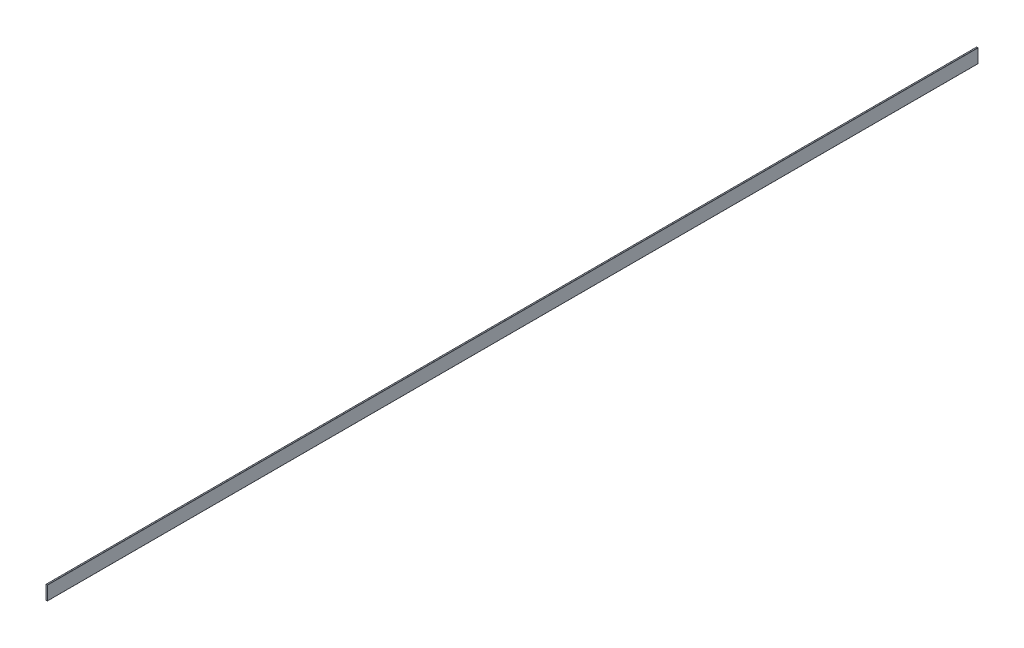
ISO-10303-21;
HEADER;
FILE_DESCRIPTION(('STEP AP214'),'2;1');
FILE_NAME('part.step','',(''),(''),'','','');
FILE_SCHEMA(('AUTOMOTIVE_DESIGN { 1 0 10303 214 1 1 1 1 }'));
ENDSEC;
DATA;
#1=APPLICATION_CONTEXT('core data for automotive mechanical design processes');
#2=APPLICATION_PROTOCOL_DEFINITION('international standard','automotive_design',2000,#1);
#3=PRODUCT_CONTEXT('',#1,'mechanical');
#4=PRODUCT('Part','Part','',(#3));
#5=PRODUCT_RELATED_PRODUCT_CATEGORY('part','',(#4));
#6=PRODUCT_DEFINITION_FORMATION('','',#4);
#7=PRODUCT_DEFINITION_CONTEXT('part definition',#1,'design');
#8=PRODUCT_DEFINITION('design','',#6,#7);
#9=PRODUCT_DEFINITION_SHAPE('','',#8);
#10=(LENGTH_UNIT() NAMED_UNIT(*) SI_UNIT(.MILLI.,.METRE.));
#11=(NAMED_UNIT(*) PLANE_ANGLE_UNIT() SI_UNIT($,.RADIAN.));
#12=(NAMED_UNIT(*) SI_UNIT($,.STERADIAN.) SOLID_ANGLE_UNIT());
#13=UNCERTAINTY_MEASURE_WITH_UNIT(LENGTH_MEASURE(1.E-05),#10,'distance_accuracy_value','');
#14=(GEOMETRIC_REPRESENTATION_CONTEXT(3) GLOBAL_UNCERTAINTY_ASSIGNED_CONTEXT((#13)) GLOBAL_UNIT_ASSIGNED_CONTEXT((#10,
#11,#12)) REPRESENTATION_CONTEXT('',''));
#15=CARTESIAN_POINT('',(0.,0.,0.));
#16=DIRECTION('',(0.,0.,1.));
#17=DIRECTION('',(1.,0.,0.));
#18=AXIS2_PLACEMENT_3D('',#15,#16,#17);
#19=CARTESIAN_POINT('',(-1.15,-14.65,-1000.));
#20=DIRECTION('',(0.,0.,1.));
#21=DIRECTION('',(1.,0.,0.));
#22=AXIS2_PLACEMENT_3D('',#19,#20,#21);
#23=CYLINDRICAL_SURFACE('',#22,0.35);
#24=DIRECTION('',(0.,0.,1.));
#25=VECTOR('',#24,1.);
#26=CARTESIAN_POINT('',(-1.15,-15.,-1000.));
#27=LINE('',#26,#25);
#28=CARTESIAN_POINT('',(-1.15,-15.,-1000.));
#29=VERTEX_POINT('',#28);
#30=CARTESIAN_POINT('',(-1.15,-15.,1000.));
#31=VERTEX_POINT('',#30);
#32=EDGE_CURVE('E42',#29,#31,#27,.T.);
#33=ORIENTED_EDGE('',*,*,#32,.T.);
#34=CARTESIAN_POINT('',(-1.15,-14.65,1000.));
#35=DIRECTION('',(0.,0.,1.));
#36=DIRECTION('',(-1.,0.,0.));
#37=AXIS2_PLACEMENT_3D('',#34,#35,#36);
#38=CIRCLE('',#37,0.35);
#39=CARTESIAN_POINT('',(-1.5,-14.65,1000.));
#40=VERTEX_POINT('',#39);
#41=EDGE_CURVE('E104',#40,#31,#38,.T.);
#42=ORIENTED_EDGE('',*,*,#41,.F.);
#43=DIRECTION('',(0.,0.,1.));
#44=VECTOR('',#43,1.);
#45=CARTESIAN_POINT('',(-1.5,-14.65,-1000.));
#46=LINE('',#45,#44);
#47=CARTESIAN_POINT('',(-1.5,-14.65,-1000.));
#48=VERTEX_POINT('',#47);
#49=EDGE_CURVE('E11',#48,#40,#46,.T.);
#50=ORIENTED_EDGE('',*,*,#49,.F.);
#51=CARTESIAN_POINT('',(-1.15,-14.65,-1000.));
#52=DIRECTION('',(0.,0.,1.));
#53=DIRECTION('',(-1.,0.,0.));
#54=AXIS2_PLACEMENT_3D('',#51,#52,#53);
#55=CIRCLE('',#54,0.35);
#56=EDGE_CURVE('E105',#48,#29,#55,.T.);
#57=ORIENTED_EDGE('',*,*,#56,.T.);
#58=EDGE_LOOP('',(#33,#42,#50,#57));
#59=FACE_BOUND('',#58,.T.);
#60=ADVANCED_FACE('F39',(#59),#23,.T.);
#61=CARTESIAN_POINT('',(-1.5,-14.65,-1000.));
#62=DIRECTION('',(-1.,0.,0.));
#63=DIRECTION('',(0.,0.,1.));
#64=AXIS2_PLACEMENT_3D('',#61,#62,#63);
#65=PLANE('',#64);
#66=ORIENTED_EDGE('',*,*,#49,.T.);
#67=DIRECTION('',(0.,-1.,0.));
#68=VECTOR('',#67,1.);
#69=CARTESIAN_POINT('',(-1.5,-14.65,1000.));
#70=LINE('',#69,#68);
#71=CARTESIAN_POINT('',(-1.5,14.65,1000.));
#72=VERTEX_POINT('',#71);
#73=EDGE_CURVE('E124',#72,#40,#70,.T.);
#74=ORIENTED_EDGE('',*,*,#73,.F.);
#75=DIRECTION('',(0.,0.,1.));
#76=VECTOR('',#75,1.);
#77=CARTESIAN_POINT('',(-1.5,14.65,-1000.));
#78=LINE('',#77,#76);
#79=CARTESIAN_POINT('',(-1.5,14.65,-1000.));
#80=VERTEX_POINT('',#79);
#81=EDGE_CURVE('E48',#80,#72,#78,.T.);
#82=ORIENTED_EDGE('',*,*,#81,.F.);
#83=DIRECTION('',(0.,-1.,0.));
#84=VECTOR('',#83,1.);
#85=CARTESIAN_POINT('',(-1.5,-14.65,-1000.));
#86=LINE('',#85,#84);
#87=EDGE_CURVE('E111',#80,#48,#86,.T.);
#88=ORIENTED_EDGE('',*,*,#87,.T.);
#89=EDGE_LOOP('',(#66,#74,#82,#88));
#90=FACE_BOUND('',#89,.T.);
#91=ADVANCED_FACE('F209',(#90),#65,.T.);
#92=CARTESIAN_POINT('',(-1.15,14.65,-1000.));
#93=DIRECTION('',(0.,0.,1.));
#94=DIRECTION('',(1.,0.,0.));
#95=AXIS2_PLACEMENT_3D('',#92,#93,#94);
#96=CYLINDRICAL_SURFACE('',#95,0.35);
#97=ORIENTED_EDGE('',*,*,#81,.T.);
#98=CARTESIAN_POINT('',(-1.15,14.65,1000.));
#99=DIRECTION('',(0.,0.,1.));
#100=DIRECTION('',(-1.,0.,0.));
#101=AXIS2_PLACEMENT_3D('',#98,#99,#100);
#102=CIRCLE('',#101,0.35);
#103=CARTESIAN_POINT('',(-1.15,15.,1000.));
#104=VERTEX_POINT('',#103);
#105=EDGE_CURVE('E142',#104,#72,#102,.T.);
#106=ORIENTED_EDGE('',*,*,#105,.F.);
#107=DIRECTION('',(0.,0.,1.));
#108=VECTOR('',#107,1.);
#109=CARTESIAN_POINT('',(-1.15,15.,-1000.));
#110=LINE('',#109,#108);
#111=CARTESIAN_POINT('',(-1.15,15.,-1000.));
#112=VERTEX_POINT('',#111);
#113=EDGE_CURVE('E175',#112,#104,#110,.T.);
#114=ORIENTED_EDGE('',*,*,#113,.F.);
#115=CARTESIAN_POINT('',(-1.15,14.65,-1000.));
#116=DIRECTION('',(0.,0.,1.));
#117=DIRECTION('',(-1.,0.,0.));
#118=AXIS2_PLACEMENT_3D('',#115,#116,#117);
#119=CIRCLE('',#118,0.35);
#120=EDGE_CURVE('E168',#112,#80,#119,.T.);
#121=ORIENTED_EDGE('',*,*,#120,.T.);
#122=EDGE_LOOP('',(#97,#106,#114,#121));
#123=FACE_BOUND('',#122,.T.);
#124=ADVANCED_FACE('F208',(#123),#96,.T.);
#125=CARTESIAN_POINT('',(-1.15,15.,-1000.));
#126=DIRECTION('',(0.,1.,0.));
#127=DIRECTION('',(0.,0.,1.));
#128=AXIS2_PLACEMENT_3D('',#125,#126,#127);
#129=PLANE('',#128);
#130=ORIENTED_EDGE('',*,*,#113,.T.);
#131=DIRECTION('',(-1.,0.,0.));
#132=VECTOR('',#131,1.);
#133=CARTESIAN_POINT('',(-1.15,15.,1000.));
#134=LINE('',#133,#132);
#135=CARTESIAN_POINT('',(1.15,15.,1000.));
#136=VERTEX_POINT('',#135);
#137=EDGE_CURVE('E138',#136,#104,#134,.T.);
#138=ORIENTED_EDGE('',*,*,#137,.F.);
#139=DIRECTION('',(0.,0.,1.));
#140=VECTOR('',#139,1.);
#141=CARTESIAN_POINT('',(1.15,15.,-1000.));
#142=LINE('',#141,#140);
#143=CARTESIAN_POINT('',(1.15,15.,-1000.));
#144=VERTEX_POINT('',#143);
#145=EDGE_CURVE('E178',#144,#136,#142,.T.);
#146=ORIENTED_EDGE('',*,*,#145,.F.);
#147=DIRECTION('',(-1.,0.,0.));
#148=VECTOR('',#147,1.);
#149=CARTESIAN_POINT('',(-1.15,15.,-1000.));
#150=LINE('',#149,#148);
#151=EDGE_CURVE('E164',#144,#112,#150,.T.);
#152=ORIENTED_EDGE('',*,*,#151,.T.);
#153=EDGE_LOOP('',(#130,#138,#146,#152));
#154=FACE_BOUND('',#153,.T.);
#155=ADVANCED_FACE('F204',(#154),#129,.T.);
#156=CARTESIAN_POINT('',(1.15,14.65,-1000.));
#157=DIRECTION('',(0.,0.,1.));
#158=DIRECTION('',(1.,0.,0.));
#159=AXIS2_PLACEMENT_3D('',#156,#157,#158);
#160=CYLINDRICAL_SURFACE('',#159,0.35);
#161=ORIENTED_EDGE('',*,*,#145,.T.);
#162=CARTESIAN_POINT('',(1.15,14.65,1000.));
#163=DIRECTION('',(0.,0.,1.));
#164=DIRECTION('',(-1.,0.,0.));
#165=AXIS2_PLACEMENT_3D('',#162,#163,#164);
#166=CIRCLE('',#165,0.35);
#167=CARTESIAN_POINT('',(1.5,14.65,1000.));
#168=VERTEX_POINT('',#167);
#169=EDGE_CURVE('E134',#168,#136,#166,.T.);
#170=ORIENTED_EDGE('',*,*,#169,.F.);
#171=DIRECTION('',(0.,0.,1.));
#172=VECTOR('',#171,1.);
#173=CARTESIAN_POINT('',(1.5,14.65,-1000.));
#174=LINE('',#173,#172);
#175=CARTESIAN_POINT('',(1.5,14.65,-1000.));
#176=VERTEX_POINT('',#175);
#177=EDGE_CURVE('E181',#176,#168,#174,.T.);
#178=ORIENTED_EDGE('',*,*,#177,.F.);
#179=CARTESIAN_POINT('',(1.15,14.65,-1000.));
#180=DIRECTION('',(0.,0.,1.));
#181=DIRECTION('',(-1.,0.,0.));
#182=AXIS2_PLACEMENT_3D('',#179,#180,#181);
#183=CIRCLE('',#182,0.35);
#184=EDGE_CURVE('E160',#176,#144,#183,.T.);
#185=ORIENTED_EDGE('',*,*,#184,.T.);
#186=EDGE_LOOP('',(#161,#170,#178,#185));
#187=FACE_BOUND('',#186,.T.);
#188=ADVANCED_FACE('F197',(#187),#160,.T.);
#189=CARTESIAN_POINT('',(1.5,-14.65,-1000.));
#190=DIRECTION('',(1.,0.,0.));
#191=DIRECTION('',(0.,0.,-1.));
#192=AXIS2_PLACEMENT_3D('',#189,#190,#191);
#193=PLANE('',#192);
#194=ORIENTED_EDGE('',*,*,#177,.T.);
#195=DIRECTION('',(0.,1.,0.));
#196=VECTOR('',#195,1.);
#197=CARTESIAN_POINT('',(1.5,-14.65,1000.));
#198=LINE('',#197,#196);
#199=CARTESIAN_POINT('',(1.5,-14.65,1000.));
#200=VERTEX_POINT('',#199);
#201=EDGE_CURVE('E130',#200,#168,#198,.T.);
#202=ORIENTED_EDGE('',*,*,#201,.F.);
#203=DIRECTION('',(0.,0.,1.));
#204=VECTOR('',#203,1.);
#205=CARTESIAN_POINT('',(1.5,-14.65,-1000.));
#206=LINE('',#205,#204);
#207=CARTESIAN_POINT('',(1.5,-14.65,-1000.));
#208=VERTEX_POINT('',#207);
#209=EDGE_CURVE('E184',#208,#200,#206,.T.);
#210=ORIENTED_EDGE('',*,*,#209,.F.);
#211=DIRECTION('',(0.,1.,0.));
#212=VECTOR('',#211,1.);
#213=CARTESIAN_POINT('',(1.5,-14.65,-1000.));
#214=LINE('',#213,#212);
#215=EDGE_CURVE('E156',#208,#176,#214,.T.);
#216=ORIENTED_EDGE('',*,*,#215,.T.);
#217=EDGE_LOOP('',(#194,#202,#210,#216));
#218=FACE_BOUND('',#217,.T.);
#219=ADVANCED_FACE('F194',(#218),#193,.T.);
#220=CARTESIAN_POINT('',(1.15,-14.65,-1000.));
#221=DIRECTION('',(0.,0.,1.));
#222=DIRECTION('',(1.,0.,0.));
#223=AXIS2_PLACEMENT_3D('',#220,#221,#222);
#224=CYLINDRICAL_SURFACE('',#223,0.35);
#225=ORIENTED_EDGE('',*,*,#209,.T.);
#226=CARTESIAN_POINT('',(1.15,-14.65,1000.));
#227=DIRECTION('',(0.,0.,1.));
#228=DIRECTION('',(1.,0.,0.));
#229=AXIS2_PLACEMENT_3D('',#226,#227,#228);
#230=CIRCLE('',#229,0.35);
#231=CARTESIAN_POINT('',(1.15,-15.,1000.));
#232=VERTEX_POINT('',#231);
#233=EDGE_CURVE('E119',#232,#200,#230,.T.);
#234=ORIENTED_EDGE('',*,*,#233,.F.);
#235=DIRECTION('',(0.,0.,1.));
#236=VECTOR('',#235,1.);
#237=CARTESIAN_POINT('',(1.15,-15.,-1000.));
#238=LINE('',#237,#236);
#239=CARTESIAN_POINT('',(1.15,-15.,-1000.));
#240=VERTEX_POINT('',#239);
#241=EDGE_CURVE('E110',#240,#232,#238,.T.);
#242=ORIENTED_EDGE('',*,*,#241,.F.);
#243=CARTESIAN_POINT('',(1.15,-14.65,-1000.));
#244=DIRECTION('',(0.,0.,1.));
#245=DIRECTION('',(1.,0.,0.));
#246=AXIS2_PLACEMENT_3D('',#243,#244,#245);
#247=CIRCLE('',#246,0.35);
#248=EDGE_CURVE('E152',#240,#208,#247,.T.);
#249=ORIENTED_EDGE('',*,*,#248,.T.);
#250=EDGE_LOOP('',(#225,#234,#242,#249));
#251=FACE_BOUND('',#250,.T.);
#252=ADVANCED_FACE('F188',(#251),#224,.T.);
#253=CARTESIAN_POINT('',(-1.15,-15.,-1000.));
#254=DIRECTION('',(0.,-1.,0.));
#255=DIRECTION('',(0.,0.,-1.));
#256=AXIS2_PLACEMENT_3D('',#253,#254,#255);
#257=PLANE('',#256);
#258=ORIENTED_EDGE('',*,*,#241,.T.);
#259=DIRECTION('',(1.,0.,0.));
#260=VECTOR('',#259,1.);
#261=CARTESIAN_POINT('',(-1.15,-15.,1000.));
#262=LINE('',#261,#260);
#263=EDGE_CURVE('E113',#31,#232,#262,.T.);
#264=ORIENTED_EDGE('',*,*,#263,.F.);
#265=ORIENTED_EDGE('',*,*,#32,.F.);
#266=DIRECTION('',(1.,0.,0.));
#267=VECTOR('',#266,1.);
#268=CARTESIAN_POINT('',(-1.15,-15.,-1000.));
#269=LINE('',#268,#267);
#270=EDGE_CURVE('E149',#29,#240,#269,.T.);
#271=ORIENTED_EDGE('',*,*,#270,.T.);
#272=EDGE_LOOP('',(#258,#264,#265,#271));
#273=FACE_BOUND('',#272,.T.);
#274=ADVANCED_FACE('F114',(#273),#257,.T.);
#275=CARTESIAN_POINT('',(-1.15,-14.65,-1000.));
#276=DIRECTION('',(0.,0.,-1.));
#277=DIRECTION('',(-1.,0.,0.));
#278=AXIS2_PLACEMENT_3D('',#275,#276,#277);
#279=PLANE('',#278);
#280=ORIENTED_EDGE('',*,*,#56,.F.);
#281=ORIENTED_EDGE('',*,*,#87,.F.);
#282=ORIENTED_EDGE('',*,*,#120,.F.);
#283=ORIENTED_EDGE('',*,*,#151,.F.);
#284=ORIENTED_EDGE('',*,*,#184,.F.);
#285=ORIENTED_EDGE('',*,*,#215,.F.);
#286=ORIENTED_EDGE('',*,*,#248,.F.);
#287=ORIENTED_EDGE('',*,*,#270,.F.);
#288=EDGE_LOOP('',(#280,#281,#282,#283,#284,#285,#286,#287));
#289=FACE_BOUND('',#288,.T.);
#290=ADVANCED_FACE('F200',(#289),#279,.T.);
#291=CARTESIAN_POINT('',(-1.15,-14.65,1000.));
#292=DIRECTION('',(0.,0.,-1.));
#293=DIRECTION('',(-1.,0.,0.));
#294=AXIS2_PLACEMENT_3D('',#291,#292,#293);
#295=PLANE('',#294);
#296=ORIENTED_EDGE('',*,*,#41,.T.);
#297=ORIENTED_EDGE('',*,*,#263,.T.);
#298=ORIENTED_EDGE('',*,*,#233,.T.);
#299=ORIENTED_EDGE('',*,*,#201,.T.);
#300=ORIENTED_EDGE('',*,*,#169,.T.);
#301=ORIENTED_EDGE('',*,*,#137,.T.);
#302=ORIENTED_EDGE('',*,*,#105,.T.);
#303=ORIENTED_EDGE('',*,*,#73,.T.);
#304=EDGE_LOOP('',(#296,#297,#298,#299,#300,#301,#302,#303));
#305=FACE_BOUND('',#304,.T.);
#306=ADVANCED_FACE('F122',(#305),#295,.F.);
#307=CLOSED_SHELL('',(#60,#91,#124,#155,#188,#219,#252,#274,#290,#306));
#308=MANIFOLD_SOLID_BREP('B2',#307);
#309=ADVANCED_BREP_SHAPE_REPRESENTATION('',(#18,#308),#14);
#310=SHAPE_DEFINITION_REPRESENTATION(#9,#309);
ENDSEC;
END-ISO-10303-21;
